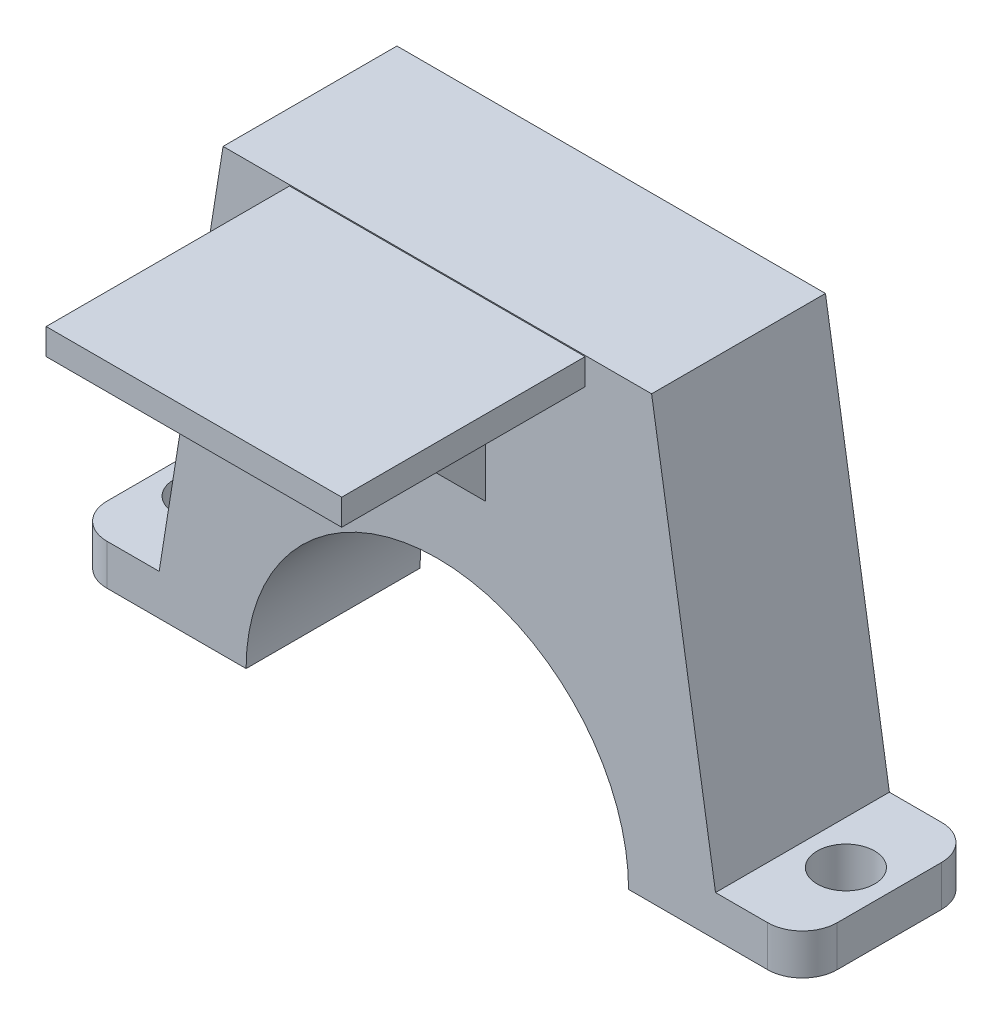
ISO-10303-21;
HEADER;
FILE_DESCRIPTION(('STEP AP214'),'2;1');
FILE_NAME('part.step','',(''),(''),'','','');
FILE_SCHEMA(('AUTOMOTIVE_DESIGN { 1 0 10303 214 1 1 1 1 }'));
ENDSEC;
DATA;
#1=APPLICATION_CONTEXT('core data for automotive mechanical design processes');
#2=APPLICATION_PROTOCOL_DEFINITION('international standard','automotive_design',2000,#1);
#3=PRODUCT_CONTEXT('',#1,'mechanical');
#4=PRODUCT('Part','Part','',(#3));
#5=PRODUCT_RELATED_PRODUCT_CATEGORY('part','',(#4));
#6=PRODUCT_DEFINITION_FORMATION('','',#4);
#7=PRODUCT_DEFINITION_CONTEXT('part definition',#1,'design');
#8=PRODUCT_DEFINITION('design','',#6,#7);
#9=PRODUCT_DEFINITION_SHAPE('','',#8);
#10=(LENGTH_UNIT() NAMED_UNIT(*) SI_UNIT(.MILLI.,.METRE.));
#11=(NAMED_UNIT(*) PLANE_ANGLE_UNIT() SI_UNIT($,.RADIAN.));
#12=(NAMED_UNIT(*) SI_UNIT($,.STERADIAN.) SOLID_ANGLE_UNIT());
#13=UNCERTAINTY_MEASURE_WITH_UNIT(LENGTH_MEASURE(1.E-05),#10,'distance_accuracy_value','');
#14=(GEOMETRIC_REPRESENTATION_CONTEXT(3) GLOBAL_UNCERTAINTY_ASSIGNED_CONTEXT((#13)) GLOBAL_UNIT_ASSIGNED_CONTEXT((#10,
#11,#12)) REPRESENTATION_CONTEXT('',''));
#15=CARTESIAN_POINT('',(0.,0.,0.));
#16=DIRECTION('',(0.,0.,1.));
#17=DIRECTION('',(1.,0.,0.));
#18=AXIS2_PLACEMENT_3D('',#15,#16,#17);
#19=CARTESIAN_POINT('',(0.,0.,10.));
#20=DIRECTION('',(0.,0.,-1.));
#21=DIRECTION('',(-1.,0.,0.));
#22=AXIS2_PLACEMENT_3D('',#19,#20,#21);
#23=PLANE('',#22);
#24=DIRECTION('',(-1.,0.,0.));
#25=VECTOR('',#24,1.);
#26=CARTESIAN_POINT('',(21.,0.,10.));
#27=LINE('',#26,#25);
#28=CARTESIAN_POINT('',(19.,0.,10.));
#29=VERTEX_POINT('',#28);
#30=CARTESIAN_POINT('',(11.,0.,10.));
#31=VERTEX_POINT('',#30);
#32=EDGE_CURVE('E247',#29,#31,#27,.T.);
#33=ORIENTED_EDGE('',*,*,#32,.F.);
#34=DIRECTION('',(0.,-1.,0.));
#35=VECTOR('',#34,1.);
#36=CARTESIAN_POINT('',(19.,2.34373044658664,10.));
#37=LINE('',#36,#35);
#38=CARTESIAN_POINT('',(19.,2.34373044658664,10.));
#39=VERTEX_POINT('',#38);
#40=EDGE_CURVE('E355',#29,#39,#37,.F.);
#41=ORIENTED_EDGE('',*,*,#40,.T.);
#42=DIRECTION('',(1.,0.,0.));
#43=VECTOR('',#42,1.);
#44=CARTESIAN_POINT('',(16.,2.34373044658664,10.));
#45=LINE('',#44,#43);
#46=CARTESIAN_POINT('',(16.,2.34373044658664,10.));
#47=VERTEX_POINT('',#46);
#48=EDGE_CURVE('E249',#47,#39,#45,.T.);
#49=ORIENTED_EDGE('',*,*,#48,.F.);
#50=DIRECTION('',(0.157759786540045,-0.987477518605279,0.));
#51=VECTOR('',#50,1.);
#52=CARTESIAN_POINT('',(12.3244688490504,25.3502548600488,10.));
#53=LINE('',#52,#51);
#54=CARTESIAN_POINT('',(12.3244688490504,25.3502548600488,10.));
#55=VERTEX_POINT('',#54);
#56=EDGE_CURVE('E253',#55,#47,#53,.T.);
#57=ORIENTED_EDGE('',*,*,#56,.F.);
#58=DIRECTION('',(-1.,0.,0.));
#59=VECTOR('',#58,1.);
#60=CARTESIAN_POINT('',(-12.3244688490504,25.3502548600488,10.));
#61=LINE('',#60,#59);
#62=CARTESIAN_POINT('',(-12.3244688490504,25.3502548600488,10.));
#63=VERTEX_POINT('',#62);
#64=EDGE_CURVE('E283',#55,#63,#61,.T.);
#65=ORIENTED_EDGE('',*,*,#64,.T.);
#66=DIRECTION('',(-0.157759786540045,-0.987477518605279,0.));
#67=VECTOR('',#66,1.);
#68=CARTESIAN_POINT('',(-12.3244688490504,25.3502548600488,10.));
#69=LINE('',#68,#67);
#70=CARTESIAN_POINT('',(-16.,2.34373044658664,10.));
#71=VERTEX_POINT('',#70);
#72=EDGE_CURVE('E286',#63,#71,#69,.T.);
#73=ORIENTED_EDGE('',*,*,#72,.T.);
#74=DIRECTION('',(-1.,0.,0.));
#75=VECTOR('',#74,1.);
#76=CARTESIAN_POINT('',(-16.,2.34373044658664,10.));
#77=LINE('',#76,#75);
#78=CARTESIAN_POINT('',(-19.,2.34373044658664,10.));
#79=VERTEX_POINT('',#78);
#80=EDGE_CURVE('E288',#71,#79,#77,.T.);
#81=ORIENTED_EDGE('',*,*,#80,.T.);
#82=DIRECTION('',(0.,-1.,0.));
#83=VECTOR('',#82,1.);
#84=CARTESIAN_POINT('',(-19.,0.,10.));
#85=LINE('',#84,#83);
#86=CARTESIAN_POINT('',(-19.,0.,10.));
#87=VERTEX_POINT('',#86);
#88=EDGE_CURVE('E336',#79,#87,#85,.T.);
#89=ORIENTED_EDGE('',*,*,#88,.T.);
#90=DIRECTION('',(1.,0.,0.));
#91=VECTOR('',#90,1.);
#92=CARTESIAN_POINT('',(-21.,0.,10.));
#93=LINE('',#92,#91);
#94=CARTESIAN_POINT('',(-11.,0.,10.));
#95=VERTEX_POINT('',#94);
#96=EDGE_CURVE('E291',#87,#95,#93,.T.);
#97=ORIENTED_EDGE('',*,*,#96,.T.);
#98=CARTESIAN_POINT('',(0.,0.,10.));
#99=DIRECTION('',(0.,0.,-1.));
#100=DIRECTION('',(-1.,0.,0.));
#101=AXIS2_PLACEMENT_3D('',#98,#99,#100);
#102=CIRCLE('',#101,11.);
#103=EDGE_CURVE('E280',#95,#31,#102,.T.);
#104=ORIENTED_EDGE('',*,*,#103,.T.);
#105=EDGE_LOOP('',(#33,#41,#49,#57,#65,#73,#81,#89,#97,#104));
#106=FACE_BOUND('',#105,.T.);
#107=DIRECTION('',(0.,1.,0.));
#108=VECTOR('',#107,1.);
#109=CARTESIAN_POINT('',(2.76086418443478,13.7897174261169,10.));
#110=LINE('',#109,#108);
#111=CARTESIAN_POINT('',(2.76086418443478,15.2184504977907,10.));
#112=VERTEX_POINT('',#111);
#113=CARTESIAN_POINT('',(2.76086418443478,23.7897174261169,10.));
#114=VERTEX_POINT('',#113);
#115=EDGE_CURVE('E190',#112,#114,#110,.T.);
#116=ORIENTED_EDGE('',*,*,#115,.F.);
#117=DIRECTION('',(-1.,0.,0.));
#118=VECTOR('',#117,1.);
#119=CARTESIAN_POINT('',(0.,15.2184504977907,10.));
#120=LINE('',#119,#118);
#121=CARTESIAN_POINT('',(-2.76086418443478,15.2184504977907,10.));
#122=VERTEX_POINT('',#121);
#123=EDGE_CURVE('E11',#112,#122,#120,.T.);
#124=ORIENTED_EDGE('',*,*,#123,.T.);
#125=DIRECTION('',(0.,1.,0.));
#126=VECTOR('',#125,1.);
#127=CARTESIAN_POINT('',(-2.76086418443478,13.7897174261169,10.));
#128=LINE('',#127,#126);
#129=CARTESIAN_POINT('',(-2.76086418443478,23.7897174261169,10.));
#130=VERTEX_POINT('',#129);
#131=EDGE_CURVE('E182',#122,#130,#128,.T.);
#132=ORIENTED_EDGE('',*,*,#131,.T.);
#133=DIRECTION('',(1.,0.,0.));
#134=VECTOR('',#133,1.);
#135=CARTESIAN_POINT('',(-8.5,23.7897174261169,10.));
#136=LINE('',#135,#134);
#137=CARTESIAN_POINT('',(-8.5,23.7897174261169,10.));
#138=VERTEX_POINT('',#137);
#139=EDGE_CURVE('E185',#138,#130,#136,.T.);
#140=ORIENTED_EDGE('',*,*,#139,.F.);
#141=DIRECTION('',(0.,-1.,0.));
#142=VECTOR('',#141,1.);
#143=CARTESIAN_POINT('',(-8.5,25.2897174261169,10.));
#144=LINE('',#143,#142);
#145=CARTESIAN_POINT('',(-8.5,25.2897174261169,10.));
#146=VERTEX_POINT('',#145);
#147=EDGE_CURVE('E189',#146,#138,#144,.T.);
#148=ORIENTED_EDGE('',*,*,#147,.F.);
#149=DIRECTION('',(1.,0.,0.));
#150=VECTOR('',#149,1.);
#151=CARTESIAN_POINT('',(-8.5,25.2897174261169,10.));
#152=LINE('',#151,#150);
#153=CARTESIAN_POINT('',(8.5,25.2897174261169,10.));
#154=VERTEX_POINT('',#153);
#155=EDGE_CURVE('E218',#146,#154,#152,.T.);
#156=ORIENTED_EDGE('',*,*,#155,.T.);
#157=DIRECTION('',(0.,-1.,0.));
#158=VECTOR('',#157,1.);
#159=CARTESIAN_POINT('',(8.5,25.2897174261169,10.));
#160=LINE('',#159,#158);
#161=CARTESIAN_POINT('',(8.5,23.7897174261169,10.));
#162=VERTEX_POINT('',#161);
#163=EDGE_CURVE('E202',#154,#162,#160,.T.);
#164=ORIENTED_EDGE('',*,*,#163,.T.);
#165=EDGE_CURVE('E203',#114,#162,#136,.T.);
#166=ORIENTED_EDGE('',*,*,#165,.F.);
#167=EDGE_LOOP('',(#116,#124,#132,#140,#148,#156,#164,#166));
#168=FACE_BOUND('',#167,.T.);
#169=ADVANCED_FACE('F43',(#106,#168),#23,.F.);
#170=CARTESIAN_POINT('',(-8.5,23.7897174261169,24.));
#171=DIRECTION('',(0.,1.,0.));
#172=DIRECTION('',(0.,0.,1.));
#173=AXIS2_PLACEMENT_3D('',#170,#171,#172);
#174=PLANE('',#173);
#175=DIRECTION('',(0.,0.,1.));
#176=VECTOR('',#175,1.);
#177=CARTESIAN_POINT('',(2.76086418443478,23.7897174261169,18.5712669283263));
#178=LINE('',#177,#176);
#179=CARTESIAN_POINT('',(2.76086418443478,23.7897174261169,18.5712669283263));
#180=VERTEX_POINT('',#179);
#181=EDGE_CURVE('E210',#114,#180,#178,.T.);
#182=ORIENTED_EDGE('',*,*,#181,.F.);
#183=ORIENTED_EDGE('',*,*,#165,.T.);
#184=DIRECTION('',(0.,0.,-1.));
#185=VECTOR('',#184,1.);
#186=CARTESIAN_POINT('',(8.5,23.7897174261169,24.));
#187=LINE('',#186,#185);
#188=CARTESIAN_POINT('',(8.5,23.7897174261169,24.));
#189=VERTEX_POINT('',#188);
#190=EDGE_CURVE('E236',#189,#162,#187,.T.);
#191=ORIENTED_EDGE('',*,*,#190,.F.);
#192=DIRECTION('',(1.,0.,0.));
#193=VECTOR('',#192,1.);
#194=CARTESIAN_POINT('',(-8.5,23.7897174261169,24.));
#195=LINE('',#194,#193);
#196=CARTESIAN_POINT('',(-8.5,23.7897174261169,24.));
#197=VERTEX_POINT('',#196);
#198=EDGE_CURVE('E217',#197,#189,#195,.T.);
#199=ORIENTED_EDGE('',*,*,#198,.F.);
#200=DIRECTION('',(0.,0.,-1.));
#201=VECTOR('',#200,1.);
#202=CARTESIAN_POINT('',(-8.5,23.7897174261169,24.));
#203=LINE('',#202,#201);
#204=EDGE_CURVE('E200',#197,#138,#203,.T.);
#205=ORIENTED_EDGE('',*,*,#204,.T.);
#206=ORIENTED_EDGE('',*,*,#139,.T.);
#207=DIRECTION('',(0.,0.,-1.));
#208=VECTOR('',#207,1.);
#209=CARTESIAN_POINT('',(-2.76086418443478,23.7897174261169,18.5712669283263));
#210=LINE('',#209,#208);
#211=CARTESIAN_POINT('',(-2.76086418443478,23.7897174261169,18.5712669283263));
#212=VERTEX_POINT('',#211);
#213=EDGE_CURVE('E197',#212,#130,#210,.T.);
#214=ORIENTED_EDGE('',*,*,#213,.F.);
#215=DIRECTION('',(-1.,0.,0.));
#216=VECTOR('',#215,1.);
#217=CARTESIAN_POINT('',(-2.76086418443478,23.7897174261169,18.5712669283263));
#218=LINE('',#217,#216);
#219=EDGE_CURVE('E207',#180,#212,#218,.T.);
#220=ORIENTED_EDGE('',*,*,#219,.F.);
#221=EDGE_LOOP('',(#182,#183,#191,#199,#205,#206,#214,#220));
#222=FACE_BOUND('',#221,.T.);
#223=ADVANCED_FACE('F195',(#222),#174,.F.);
#224=CARTESIAN_POINT('',(0.,0.,10.));
#225=DIRECTION('',(0.,0.,-1.));
#226=DIRECTION('',(-1.,0.,0.));
#227=AXIS2_PLACEMENT_3D('',#224,#225,#226);
#228=CYLINDRICAL_SURFACE('',#227,11.);
#229=CARTESIAN_POINT('',(0.,0.,0.));
#230=DIRECTION('',(0.,0.,-1.));
#231=DIRECTION('',(-1.,0.,0.));
#232=AXIS2_PLACEMENT_3D('',#229,#230,#231);
#233=CIRCLE('',#232,11.);
#234=CARTESIAN_POINT('',(-11.,0.,0.));
#235=VERTEX_POINT('',#234);
#236=CARTESIAN_POINT('',(11.,0.,0.));
#237=VERTEX_POINT('',#236);
#238=EDGE_CURVE('E294',#235,#237,#233,.T.);
#239=ORIENTED_EDGE('',*,*,#238,.T.);
#240=DIRECTION('',(0.,0.,-1.));
#241=VECTOR('',#240,1.);
#242=CARTESIAN_POINT('',(11.,0.,10.));
#243=LINE('',#242,#241);
#244=EDGE_CURVE('E273',#31,#237,#243,.T.);
#245=ORIENTED_EDGE('',*,*,#244,.F.);
#246=ORIENTED_EDGE('',*,*,#103,.F.);
#247=DIRECTION('',(0.,0.,-1.));
#248=VECTOR('',#247,1.);
#249=CARTESIAN_POINT('',(-11.,0.,10.));
#250=LINE('',#249,#248);
#251=EDGE_CURVE('E293',#95,#235,#250,.T.);
#252=ORIENTED_EDGE('',*,*,#251,.T.);
#253=EDGE_LOOP('',(#239,#245,#246,#252));
#254=FACE_BOUND('',#253,.T.);
#255=ADVANCED_FACE('F421',(#254),#228,.F.);
#256=CARTESIAN_POINT('',(-12.3244688490504,25.3502548600488,10.));
#257=DIRECTION('',(0.,-1.,0.));
#258=DIRECTION('',(1.,0.,0.));
#259=AXIS2_PLACEMENT_3D('',#256,#257,#258);
#260=PLANE('',#259);
#261=DIRECTION('',(-1.,0.,0.));
#262=VECTOR('',#261,1.);
#263=CARTESIAN_POINT('',(-12.3244688490504,25.3502548600488,0.));
#264=LINE('',#263,#262);
#265=CARTESIAN_POINT('',(12.3244688490504,25.3502548600488,0.));
#266=VERTEX_POINT('',#265);
#267=CARTESIAN_POINT('',(-12.3244688490504,25.3502548600488,0.));
#268=VERTEX_POINT('',#267);
#269=EDGE_CURVE('E297',#266,#268,#264,.T.);
#270=ORIENTED_EDGE('',*,*,#269,.T.);
#271=DIRECTION('',(0.,0.,-1.));
#272=VECTOR('',#271,1.);
#273=CARTESIAN_POINT('',(-12.3244688490504,25.3502548600488,10.));
#274=LINE('',#273,#272);
#275=EDGE_CURVE('E316',#63,#268,#274,.T.);
#276=ORIENTED_EDGE('',*,*,#275,.F.);
#277=ORIENTED_EDGE('',*,*,#64,.F.);
#278=DIRECTION('',(0.,0.,-1.));
#279=VECTOR('',#278,1.);
#280=CARTESIAN_POINT('',(12.3244688490504,25.3502548600488,10.));
#281=LINE('',#280,#279);
#282=EDGE_CURVE('E256',#55,#266,#281,.T.);
#283=ORIENTED_EDGE('',*,*,#282,.T.);
#284=EDGE_LOOP('',(#270,#276,#277,#283));
#285=FACE_BOUND('',#284,.T.);
#286=ADVANCED_FACE('F393',(#285),#260,.F.);
#287=CARTESIAN_POINT('',(-12.3244688490504,25.3502548600488,10.));
#288=DIRECTION('',(0.987477518605279,-0.157759786540045,0.));
#289=DIRECTION('',(0.157759786540045,0.987477518605279,0.));
#290=AXIS2_PLACEMENT_3D('',#287,#288,#289);
#291=PLANE('',#290);
#292=DIRECTION('',(-0.157759786540045,-0.987477518605279,0.));
#293=VECTOR('',#292,1.);
#294=CARTESIAN_POINT('',(-12.3244688490504,25.3502548600488,0.));
#295=LINE('',#294,#293);
#296=CARTESIAN_POINT('',(-16.,2.34373044658664,0.));
#297=VERTEX_POINT('',#296);
#298=EDGE_CURVE('E299',#268,#297,#295,.T.);
#299=ORIENTED_EDGE('',*,*,#298,.T.);
#300=DIRECTION('',(0.,0.,-1.));
#301=VECTOR('',#300,1.);
#302=CARTESIAN_POINT('',(-16.,2.34373044658664,10.));
#303=LINE('',#302,#301);
#304=EDGE_CURVE('E313',#71,#297,#303,.T.);
#305=ORIENTED_EDGE('',*,*,#304,.F.);
#306=ORIENTED_EDGE('',*,*,#72,.F.);
#307=ORIENTED_EDGE('',*,*,#275,.T.);
#308=EDGE_LOOP('',(#299,#305,#306,#307));
#309=FACE_BOUND('',#308,.T.);
#310=ADVANCED_FACE('F395',(#309),#291,.F.);
#311=CARTESIAN_POINT('',(-16.,2.34373044658664,10.));
#312=DIRECTION('',(0.,-1.,0.));
#313=DIRECTION('',(1.,0.,0.));
#314=AXIS2_PLACEMENT_3D('',#311,#312,#313);
#315=PLANE('',#314);
#316=CARTESIAN_POINT('',(-18.5,2.34373044658664,5.));
#317=DIRECTION('',(0.,1.,0.));
#318=DIRECTION('',(-1.,0.,0.));
#319=AXIS2_PLACEMENT_3D('',#316,#317,#318);
#320=CIRCLE('',#319,1.65);
#321=CARTESIAN_POINT('',(-20.15,2.34373044658664,5.));
#322=VERTEX_POINT('',#321);
#323=EDGE_CURVE('E276',#322,#322,#320,.T.);
#324=ORIENTED_EDGE('',*,*,#323,.F.);
#325=EDGE_LOOP('',(#324));
#326=FACE_BOUND('',#325,.T.);
#327=DIRECTION('',(-1.,0.,0.));
#328=VECTOR('',#327,1.);
#329=CARTESIAN_POINT('',(-16.,2.34373044658664,0.));
#330=LINE('',#329,#328);
#331=CARTESIAN_POINT('',(-19.,2.34373044658664,0.));
#332=VERTEX_POINT('',#331);
#333=EDGE_CURVE('E301',#297,#332,#330,.T.);
#334=ORIENTED_EDGE('',*,*,#333,.T.);
#335=CARTESIAN_POINT('',(-19.,2.34373044658664,2.));
#336=DIRECTION('',(0.,-1.,0.));
#337=DIRECTION('',(1.,0.,0.));
#338=AXIS2_PLACEMENT_3D('',#335,#336,#337);
#339=CIRCLE('',#338,2.);
#340=CARTESIAN_POINT('',(-21.,2.34373044658664,2.));
#341=VERTEX_POINT('',#340);
#342=EDGE_CURVE('E334',#332,#341,#339,.F.);
#343=ORIENTED_EDGE('',*,*,#342,.T.);
#344=DIRECTION('',(0.,0.,-1.));
#345=VECTOR('',#344,1.);
#346=CARTESIAN_POINT('',(-21.,2.34373044658664,10.));
#347=LINE('',#346,#345);
#348=CARTESIAN_POINT('',(-21.,2.34373044658664,8.));
#349=VERTEX_POINT('',#348);
#350=EDGE_CURVE('E310',#349,#341,#347,.T.);
#351=ORIENTED_EDGE('',*,*,#350,.F.);
#352=CARTESIAN_POINT('',(-19.,2.34373044658664,8.));
#353=DIRECTION('',(0.,-1.,0.));
#354=DIRECTION('',(1.,0.,0.));
#355=AXIS2_PLACEMENT_3D('',#352,#353,#354);
#356=CIRCLE('',#355,2.);
#357=EDGE_CURVE('E332',#349,#79,#356,.F.);
#358=ORIENTED_EDGE('',*,*,#357,.T.);
#359=ORIENTED_EDGE('',*,*,#80,.F.);
#360=ORIENTED_EDGE('',*,*,#304,.T.);
#361=EDGE_LOOP('',(#334,#343,#351,#358,#359,#360));
#362=FACE_BOUND('',#361,.T.);
#363=ADVANCED_FACE('F399',(#326,#362),#315,.F.);
#364=CARTESIAN_POINT('',(-21.,0.,10.));
#365=DIRECTION('',(1.,0.,0.));
#366=DIRECTION('',(0.,0.,-1.));
#367=AXIS2_PLACEMENT_3D('',#364,#365,#366);
#368=PLANE('',#367);
#369=ORIENTED_EDGE('',*,*,#350,.T.);
#370=DIRECTION('',(0.,-1.,0.));
#371=VECTOR('',#370,1.);
#372=CARTESIAN_POINT('',(-21.,0.,2.));
#373=LINE('',#372,#371);
#374=CARTESIAN_POINT('',(-21.,0.,2.));
#375=VERTEX_POINT('',#374);
#376=EDGE_CURVE('E323',#341,#375,#373,.T.);
#377=ORIENTED_EDGE('',*,*,#376,.T.);
#378=DIRECTION('',(0.,0.,-1.));
#379=VECTOR('',#378,1.);
#380=CARTESIAN_POINT('',(-21.,0.,10.));
#381=LINE('',#380,#379);
#382=CARTESIAN_POINT('',(-21.,0.,8.));
#383=VERTEX_POINT('',#382);
#384=EDGE_CURVE('E307',#383,#375,#381,.T.);
#385=ORIENTED_EDGE('',*,*,#384,.F.);
#386=DIRECTION('',(0.,-1.,0.));
#387=VECTOR('',#386,1.);
#388=CARTESIAN_POINT('',(-21.,0.,8.));
#389=LINE('',#388,#387);
#390=EDGE_CURVE('E319',#383,#349,#389,.F.);
#391=ORIENTED_EDGE('',*,*,#390,.T.);
#392=EDGE_LOOP('',(#369,#377,#385,#391));
#393=FACE_BOUND('',#392,.T.);
#394=ADVANCED_FACE('F412',(#393),#368,.F.);
#395=CARTESIAN_POINT('',(-21.,0.,10.));
#396=DIRECTION('',(0.,1.,0.));
#397=DIRECTION('',(-1.,0.,0.));
#398=AXIS2_PLACEMENT_3D('',#395,#396,#397);
#399=PLANE('',#398);
#400=CARTESIAN_POINT('',(-18.5,0.,5.));
#401=DIRECTION('',(0.,1.,0.));
#402=DIRECTION('',(-1.,0.,0.));
#403=AXIS2_PLACEMENT_3D('',#400,#401,#402);
#404=CIRCLE('',#403,1.65);
#405=CARTESIAN_POINT('',(-20.15,0.,5.));
#406=VERTEX_POINT('',#405);
#407=EDGE_CURVE('E279',#406,#406,#404,.T.);
#408=ORIENTED_EDGE('',*,*,#407,.T.);
#409=EDGE_LOOP('',(#408));
#410=FACE_BOUND('',#409,.T.);
#411=ORIENTED_EDGE('',*,*,#384,.T.);
#412=CARTESIAN_POINT('',(-19.,0.,2.));
#413=DIRECTION('',(0.,1.,0.));
#414=DIRECTION('',(-1.,0.,0.));
#415=AXIS2_PLACEMENT_3D('',#412,#413,#414);
#416=CIRCLE('',#415,2.);
#417=CARTESIAN_POINT('',(-19.,0.,0.));
#418=VERTEX_POINT('',#417);
#419=EDGE_CURVE('E328',#375,#418,#416,.F.);
#420=ORIENTED_EDGE('',*,*,#419,.T.);
#421=DIRECTION('',(1.,0.,0.));
#422=VECTOR('',#421,1.);
#423=CARTESIAN_POINT('',(-21.,0.,0.));
#424=LINE('',#423,#422);
#425=EDGE_CURVE('E284',#418,#235,#424,.T.);
#426=ORIENTED_EDGE('',*,*,#425,.T.);
#427=ORIENTED_EDGE('',*,*,#251,.F.);
#428=ORIENTED_EDGE('',*,*,#96,.F.);
#429=CARTESIAN_POINT('',(-19.,0.,8.));
#430=DIRECTION('',(0.,1.,0.));
#431=DIRECTION('',(-1.,0.,0.));
#432=AXIS2_PLACEMENT_3D('',#429,#430,#431);
#433=CIRCLE('',#432,2.);
#434=EDGE_CURVE('E326',#87,#383,#433,.F.);
#435=ORIENTED_EDGE('',*,*,#434,.T.);
#436=EDGE_LOOP('',(#411,#420,#426,#427,#428,#435));
#437=FACE_BOUND('',#436,.T.);
#438=ADVANCED_FACE('F409',(#410,#437),#399,.F.);
#439=CARTESIAN_POINT('',(0.,0.,0.));
#440=DIRECTION('',(0.,0.,-1.));
#441=DIRECTION('',(-1.,0.,0.));
#442=AXIS2_PLACEMENT_3D('',#439,#440,#441);
#443=PLANE('',#442);
#444=DIRECTION('',(1.,0.,0.));
#445=VECTOR('',#444,1.);
#446=CARTESIAN_POINT('',(16.,2.34373044658664,0.));
#447=LINE('',#446,#445);
#448=CARTESIAN_POINT('',(16.,2.34373044658664,0.));
#449=VERTEX_POINT('',#448);
#450=CARTESIAN_POINT('',(19.,2.34373044658664,0.));
#451=VERTEX_POINT('',#450);
#452=EDGE_CURVE('E258',#449,#451,#447,.T.);
#453=ORIENTED_EDGE('',*,*,#452,.T.);
#454=DIRECTION('',(0.,-1.,0.));
#455=VECTOR('',#454,1.);
#456=CARTESIAN_POINT('',(19.,0.,0.));
#457=LINE('',#456,#455);
#458=CARTESIAN_POINT('',(19.,0.,0.));
#459=VERTEX_POINT('',#458);
#460=EDGE_CURVE('E339',#451,#459,#457,.T.);
#461=ORIENTED_EDGE('',*,*,#460,.T.);
#462=DIRECTION('',(-1.,0.,0.));
#463=VECTOR('',#462,1.);
#464=CARTESIAN_POINT('',(21.,0.,0.));
#465=LINE('',#464,#463);
#466=EDGE_CURVE('E246',#459,#237,#465,.T.);
#467=ORIENTED_EDGE('',*,*,#466,.T.);
#468=ORIENTED_EDGE('',*,*,#238,.F.);
#469=ORIENTED_EDGE('',*,*,#425,.F.);
#470=DIRECTION('',(0.,-1.,0.));
#471=VECTOR('',#470,1.);
#472=CARTESIAN_POINT('',(-19.,2.34373044658664,0.));
#473=LINE('',#472,#471);
#474=EDGE_CURVE('E330',#418,#332,#473,.F.);
#475=ORIENTED_EDGE('',*,*,#474,.T.);
#476=ORIENTED_EDGE('',*,*,#333,.F.);
#477=ORIENTED_EDGE('',*,*,#298,.F.);
#478=ORIENTED_EDGE('',*,*,#269,.F.);
#479=DIRECTION('',(0.157759786540045,-0.987477518605279,0.));
#480=VECTOR('',#479,1.);
#481=CARTESIAN_POINT('',(12.3244688490504,25.3502548600488,0.));
#482=LINE('',#481,#480);
#483=EDGE_CURVE('E250',#266,#449,#482,.T.);
#484=ORIENTED_EDGE('',*,*,#483,.T.);
#485=EDGE_LOOP('',(#453,#461,#467,#468,#469,#475,#476,#477,#478,#484));
#486=FACE_BOUND('',#485,.T.);
#487=ADVANCED_FACE('F382',(#486),#443,.T.);
#488=CARTESIAN_POINT('',(-18.5,-7.65626955341336,5.));
#489=DIRECTION('',(0.,1.,0.));
#490=DIRECTION('',(-1.,0.,0.));
#491=AXIS2_PLACEMENT_3D('',#488,#489,#490);
#492=CYLINDRICAL_SURFACE('',#491,1.65);
#493=ORIENTED_EDGE('',*,*,#323,.T.);
#494=EDGE_LOOP('',(#493));
#495=FACE_BOUND('',#494,.T.);
#496=ORIENTED_EDGE('',*,*,#407,.F.);
#497=EDGE_LOOP('',(#496));
#498=FACE_BOUND('',#497,.T.);
#499=ADVANCED_FACE('F438',(#495,#498),#492,.F.);
#500=CARTESIAN_POINT('',(-19.,0.,2.));
#501=DIRECTION('',(0.,1.,0.));
#502=DIRECTION('',(0.,0.,1.));
#503=AXIS2_PLACEMENT_3D('',#500,#501,#502);
#504=CYLINDRICAL_SURFACE('',#503,2.);
#505=ORIENTED_EDGE('',*,*,#342,.F.);
#506=ORIENTED_EDGE('',*,*,#474,.F.);
#507=ORIENTED_EDGE('',*,*,#419,.F.);
#508=ORIENTED_EDGE('',*,*,#376,.F.);
#509=EDGE_LOOP('',(#505,#506,#507,#508));
#510=FACE_BOUND('',#509,.T.);
#511=ADVANCED_FACE('F416',(#510),#504,.T.);
#512=CARTESIAN_POINT('',(-19.,0.,8.));
#513=DIRECTION('',(0.,-1.,0.));
#514=DIRECTION('',(0.,0.,-1.));
#515=AXIS2_PLACEMENT_3D('',#512,#513,#514);
#516=CYLINDRICAL_SURFACE('',#515,2.);
#517=ORIENTED_EDGE('',*,*,#357,.F.);
#518=ORIENTED_EDGE('',*,*,#390,.F.);
#519=ORIENTED_EDGE('',*,*,#434,.F.);
#520=ORIENTED_EDGE('',*,*,#88,.F.);
#521=EDGE_LOOP('',(#517,#518,#519,#520));
#522=FACE_BOUND('',#521,.T.);
#523=ADVANCED_FACE('F405',(#522),#516,.T.);
#524=CARTESIAN_POINT('',(21.,0.,10.));
#525=DIRECTION('',(0.,-1.,0.));
#526=DIRECTION('',(1.,0.,0.));
#527=AXIS2_PLACEMENT_3D('',#524,#525,#526);
#528=PLANE('',#527);
#529=CARTESIAN_POINT('',(18.5,0.,5.));
#530=DIRECTION('',(0.,-1.,0.));
#531=DIRECTION('',(1.,0.,0.));
#532=AXIS2_PLACEMENT_3D('',#529,#530,#531);
#533=CIRCLE('',#532,1.65);
#534=CARTESIAN_POINT('',(20.15,0.,5.));
#535=VERTEX_POINT('',#534);
#536=EDGE_CURVE('E243',#535,#535,#533,.F.);
#537=ORIENTED_EDGE('',*,*,#536,.T.);
#538=EDGE_LOOP('',(#537));
#539=FACE_BOUND('',#538,.T.);
#540=ORIENTED_EDGE('',*,*,#466,.F.);
#541=CARTESIAN_POINT('',(19.,0.,2.));
#542=DIRECTION('',(0.,-1.,0.));
#543=DIRECTION('',(1.,0.,0.));
#544=AXIS2_PLACEMENT_3D('',#541,#542,#543);
#545=CIRCLE('',#544,2.);
#546=CARTESIAN_POINT('',(21.,0.,2.));
#547=VERTEX_POINT('',#546);
#548=EDGE_CURVE('E344',#459,#547,#545,.T.);
#549=ORIENTED_EDGE('',*,*,#548,.T.);
#550=DIRECTION('',(0.,0.,-1.));
#551=VECTOR('',#550,1.);
#552=CARTESIAN_POINT('',(21.,0.,10.));
#553=LINE('',#552,#551);
#554=CARTESIAN_POINT('',(21.,0.,8.));
#555=VERTEX_POINT('',#554);
#556=EDGE_CURVE('E270',#555,#547,#553,.T.);
#557=ORIENTED_EDGE('',*,*,#556,.F.);
#558=CARTESIAN_POINT('',(19.,0.,8.));
#559=DIRECTION('',(0.,-1.,0.));
#560=DIRECTION('',(1.,0.,0.));
#561=AXIS2_PLACEMENT_3D('',#558,#559,#560);
#562=CIRCLE('',#561,2.);
#563=EDGE_CURVE('E342',#555,#29,#562,.T.);
#564=ORIENTED_EDGE('',*,*,#563,.T.);
#565=ORIENTED_EDGE('',*,*,#32,.T.);
#566=ORIENTED_EDGE('',*,*,#244,.T.);
#567=EDGE_LOOP('',(#540,#549,#557,#564,#565,#566));
#568=FACE_BOUND('',#567,.T.);
#569=ADVANCED_FACE('F376',(#539,#568),#528,.T.);
#570=CARTESIAN_POINT('',(21.,0.,10.));
#571=DIRECTION('',(1.,0.,0.));
#572=DIRECTION('',(0.,0.,-1.));
#573=AXIS2_PLACEMENT_3D('',#570,#571,#572);
#574=PLANE('',#573);
#575=ORIENTED_EDGE('',*,*,#556,.T.);
#576=DIRECTION('',(0.,-1.,0.));
#577=VECTOR('',#576,1.);
#578=CARTESIAN_POINT('',(21.,0.,2.));
#579=LINE('',#578,#577);
#580=CARTESIAN_POINT('',(21.,2.34373044658664,2.));
#581=VERTEX_POINT('',#580);
#582=EDGE_CURVE('E349',#547,#581,#579,.F.);
#583=ORIENTED_EDGE('',*,*,#582,.T.);
#584=DIRECTION('',(0.,0.,-1.));
#585=VECTOR('',#584,1.);
#586=CARTESIAN_POINT('',(21.,2.34373044658664,10.));
#587=LINE('',#586,#585);
#588=CARTESIAN_POINT('',(21.,2.34373044658664,8.));
#589=VERTEX_POINT('',#588);
#590=EDGE_CURVE('E267',#589,#581,#587,.T.);
#591=ORIENTED_EDGE('',*,*,#590,.F.);
#592=DIRECTION('',(0.,-1.,0.));
#593=VECTOR('',#592,1.);
#594=CARTESIAN_POINT('',(21.,0.,8.));
#595=LINE('',#594,#593);
#596=EDGE_CURVE('E346',#589,#555,#595,.T.);
#597=ORIENTED_EDGE('',*,*,#596,.T.);
#598=EDGE_LOOP('',(#575,#583,#591,#597));
#599=FACE_BOUND('',#598,.T.);
#600=ADVANCED_FACE('F372',(#599),#574,.T.);
#601=CARTESIAN_POINT('',(16.,2.34373044658664,10.));
#602=DIRECTION('',(0.,1.,0.));
#603=DIRECTION('',(-1.,0.,0.));
#604=AXIS2_PLACEMENT_3D('',#601,#602,#603);
#605=PLANE('',#604);
#606=CARTESIAN_POINT('',(18.5,2.34373044658664,5.));
#607=DIRECTION('',(0.,-1.,0.));
#608=DIRECTION('',(1.,0.,0.));
#609=AXIS2_PLACEMENT_3D('',#606,#607,#608);
#610=CIRCLE('',#609,1.65);
#611=CARTESIAN_POINT('',(20.15,2.34373044658664,5.));
#612=VERTEX_POINT('',#611);
#613=EDGE_CURVE('E240',#612,#612,#610,.T.);
#614=ORIENTED_EDGE('',*,*,#613,.T.);
#615=EDGE_LOOP('',(#614));
#616=FACE_BOUND('',#615,.T.);
#617=ORIENTED_EDGE('',*,*,#590,.T.);
#618=CARTESIAN_POINT('',(19.,2.34373044658664,2.));
#619=DIRECTION('',(0.,1.,0.));
#620=DIRECTION('',(-1.,0.,0.));
#621=AXIS2_PLACEMENT_3D('',#618,#619,#620);
#622=CIRCLE('',#621,2.);
#623=EDGE_CURVE('E353',#581,#451,#622,.T.);
#624=ORIENTED_EDGE('',*,*,#623,.T.);
#625=ORIENTED_EDGE('',*,*,#452,.F.);
#626=DIRECTION('',(0.,0.,-1.));
#627=VECTOR('',#626,1.);
#628=CARTESIAN_POINT('',(16.,2.34373044658664,10.));
#629=LINE('',#628,#627);
#630=EDGE_CURVE('E265',#47,#449,#629,.T.);
#631=ORIENTED_EDGE('',*,*,#630,.F.);
#632=ORIENTED_EDGE('',*,*,#48,.T.);
#633=CARTESIAN_POINT('',(19.,2.34373044658664,8.));
#634=DIRECTION('',(0.,1.,0.));
#635=DIRECTION('',(-1.,0.,0.));
#636=AXIS2_PLACEMENT_3D('',#633,#634,#635);
#637=CIRCLE('',#636,2.);
#638=EDGE_CURVE('E351',#39,#589,#637,.T.);
#639=ORIENTED_EDGE('',*,*,#638,.T.);
#640=EDGE_LOOP('',(#617,#624,#625,#631,#632,#639));
#641=FACE_BOUND('',#640,.T.);
#642=ADVANCED_FACE('F365',(#616,#641),#605,.T.);
#643=CARTESIAN_POINT('',(12.3244688490504,25.3502548600488,10.));
#644=DIRECTION('',(0.987477518605279,0.157759786540045,0.));
#645=DIRECTION('',(-0.157759786540045,0.987477518605279,0.));
#646=AXIS2_PLACEMENT_3D('',#643,#644,#645);
#647=PLANE('',#646);
#648=ORIENTED_EDGE('',*,*,#483,.F.);
#649=ORIENTED_EDGE('',*,*,#282,.F.);
#650=ORIENTED_EDGE('',*,*,#56,.T.);
#651=ORIENTED_EDGE('',*,*,#630,.T.);
#652=EDGE_LOOP('',(#648,#649,#650,#651));
#653=FACE_BOUND('',#652,.T.);
#654=ADVANCED_FACE('F388',(#653),#647,.T.);
#655=CARTESIAN_POINT('',(18.5,-7.65626955341336,5.));
#656=DIRECTION('',(0.,1.,0.));
#657=DIRECTION('',(-1.,0.,0.));
#658=AXIS2_PLACEMENT_3D('',#655,#656,#657);
#659=CYLINDRICAL_SURFACE('',#658,1.65);
#660=ORIENTED_EDGE('',*,*,#536,.F.);
#661=EDGE_LOOP('',(#660));
#662=FACE_BOUND('',#661,.T.);
#663=ORIENTED_EDGE('',*,*,#613,.F.);
#664=EDGE_LOOP('',(#663));
#665=FACE_BOUND('',#664,.T.);
#666=ADVANCED_FACE('F513',(#662,#665),#659,.F.);
#667=CARTESIAN_POINT('',(19.,0.,2.));
#668=DIRECTION('',(0.,-1.,0.));
#669=DIRECTION('',(0.,0.,-1.));
#670=AXIS2_PLACEMENT_3D('',#667,#668,#669);
#671=CYLINDRICAL_SURFACE('',#670,2.);
#672=ORIENTED_EDGE('',*,*,#623,.F.);
#673=ORIENTED_EDGE('',*,*,#582,.F.);
#674=ORIENTED_EDGE('',*,*,#548,.F.);
#675=ORIENTED_EDGE('',*,*,#460,.F.);
#676=EDGE_LOOP('',(#672,#673,#674,#675));
#677=FACE_BOUND('',#676,.T.);
#678=ADVANCED_FACE('F380',(#677),#671,.T.);
#679=CARTESIAN_POINT('',(19.,0.,8.));
#680=DIRECTION('',(0.,1.,0.));
#681=DIRECTION('',(0.,0.,1.));
#682=AXIS2_PLACEMENT_3D('',#679,#680,#681);
#683=CYLINDRICAL_SURFACE('',#682,2.);
#684=ORIENTED_EDGE('',*,*,#638,.F.);
#685=ORIENTED_EDGE('',*,*,#40,.F.);
#686=ORIENTED_EDGE('',*,*,#563,.F.);
#687=ORIENTED_EDGE('',*,*,#596,.F.);
#688=EDGE_LOOP('',(#684,#685,#686,#687));
#689=FACE_BOUND('',#688,.T.);
#690=ADVANCED_FACE('F369',(#689),#683,.T.);
#691=CARTESIAN_POINT('',(-8.5,25.2897174261169,24.));
#692=DIRECTION('',(1.,0.,0.));
#693=DIRECTION('',(0.,0.,-1.));
#694=AXIS2_PLACEMENT_3D('',#691,#692,#693);
#695=PLANE('',#694);
#696=ORIENTED_EDGE('',*,*,#147,.T.);
#697=ORIENTED_EDGE('',*,*,#204,.F.);
#698=DIRECTION('',(0.,-1.,0.));
#699=VECTOR('',#698,1.);
#700=CARTESIAN_POINT('',(-8.5,25.2897174261169,24.));
#701=LINE('',#700,#699);
#702=CARTESIAN_POINT('',(-8.5,25.2897174261169,24.));
#703=VERTEX_POINT('',#702);
#704=EDGE_CURVE('E214',#703,#197,#701,.T.);
#705=ORIENTED_EDGE('',*,*,#704,.F.);
#706=DIRECTION('',(0.,0.,-1.));
#707=VECTOR('',#706,1.);
#708=CARTESIAN_POINT('',(-8.5,25.2897174261169,24.));
#709=LINE('',#708,#707);
#710=EDGE_CURVE('E226',#703,#146,#709,.T.);
#711=ORIENTED_EDGE('',*,*,#710,.T.);
#712=EDGE_LOOP('',(#696,#697,#705,#711));
#713=FACE_BOUND('',#712,.T.);
#714=ADVANCED_FACE('F533',(#713),#695,.F.);
#715=CARTESIAN_POINT('',(8.5,25.2897174261169,24.));
#716=DIRECTION('',(1.,0.,0.));
#717=DIRECTION('',(0.,0.,-1.));
#718=AXIS2_PLACEMENT_3D('',#715,#716,#717);
#719=PLANE('',#718);
#720=ORIENTED_EDGE('',*,*,#163,.F.);
#721=DIRECTION('',(0.,0.,-1.));
#722=VECTOR('',#721,1.);
#723=CARTESIAN_POINT('',(8.5,25.2897174261169,24.));
#724=LINE('',#723,#722);
#725=CARTESIAN_POINT('',(8.5,25.2897174261169,24.));
#726=VERTEX_POINT('',#725);
#727=EDGE_CURVE('E233',#726,#154,#724,.T.);
#728=ORIENTED_EDGE('',*,*,#727,.F.);
#729=DIRECTION('',(0.,-1.,0.));
#730=VECTOR('',#729,1.);
#731=CARTESIAN_POINT('',(8.5,25.2897174261169,24.));
#732=LINE('',#731,#730);
#733=EDGE_CURVE('E220',#726,#189,#732,.T.);
#734=ORIENTED_EDGE('',*,*,#733,.T.);
#735=ORIENTED_EDGE('',*,*,#190,.T.);
#736=EDGE_LOOP('',(#720,#728,#734,#735));
#737=FACE_BOUND('',#736,.T.);
#738=ADVANCED_FACE('F539',(#737),#719,.T.);
#739=CARTESIAN_POINT('',(-8.5,25.2897174261169,24.));
#740=DIRECTION('',(0.,1.,0.));
#741=DIRECTION('',(0.,0.,1.));
#742=AXIS2_PLACEMENT_3D('',#739,#740,#741);
#743=PLANE('',#742);
#744=ORIENTED_EDGE('',*,*,#155,.F.);
#745=ORIENTED_EDGE('',*,*,#710,.F.);
#746=DIRECTION('',(1.,0.,0.));
#747=VECTOR('',#746,1.);
#748=CARTESIAN_POINT('',(-8.5,25.2897174261169,24.));
#749=LINE('',#748,#747);
#750=EDGE_CURVE('E223',#703,#726,#749,.T.);
#751=ORIENTED_EDGE('',*,*,#750,.T.);
#752=ORIENTED_EDGE('',*,*,#727,.T.);
#753=EDGE_LOOP('',(#744,#745,#751,#752));
#754=FACE_BOUND('',#753,.T.);
#755=ADVANCED_FACE('F547',(#754),#743,.T.);
#756=CARTESIAN_POINT('',(0.,0.,24.));
#757=DIRECTION('',(0.,0.,1.));
#758=DIRECTION('',(1.,0.,0.));
#759=AXIS2_PLACEMENT_3D('',#756,#757,#758);
#760=PLANE('',#759);
#761=ORIENTED_EDGE('',*,*,#704,.T.);
#762=ORIENTED_EDGE('',*,*,#198,.T.);
#763=ORIENTED_EDGE('',*,*,#733,.F.);
#764=ORIENTED_EDGE('',*,*,#750,.F.);
#765=EDGE_LOOP('',(#761,#762,#763,#764));
#766=FACE_BOUND('',#765,.T.);
#767=ADVANCED_FACE('F555',(#766),#760,.T.);
#768=CARTESIAN_POINT('',(2.76086418443478,13.7897174261169,18.5712669283263));
#769=DIRECTION('',(-1.,0.,0.));
#770=DIRECTION('',(0.,0.,1.));
#771=AXIS2_PLACEMENT_3D('',#768,#769,#770);
#772=PLANE('',#771);
#773=ORIENTED_EDGE('',*,*,#181,.T.);
#774=DIRECTION('',(0.,-0.707106781186544,-0.707106781186551));
#775=VECTOR('',#774,1.);
#776=CARTESIAN_POINT('',(2.76086418443478,13.7897174261169,8.57126692832614));
#777=LINE('',#776,#775);
#778=EDGE_CURVE('E52',#180,#112,#777,.T.);
#779=ORIENTED_EDGE('',*,*,#778,.T.);
#780=ORIENTED_EDGE('',*,*,#115,.T.);
#781=EDGE_LOOP('',(#773,#779,#780));
#782=FACE_BOUND('',#781,.T.);
#783=ADVANCED_FACE('F563',(#782),#772,.F.);
#784=CARTESIAN_POINT('',(-2.76086418443478,13.7897174261169,18.5712669283263));
#785=DIRECTION('',(1.,0.,0.));
#786=DIRECTION('',(0.,0.,-1.));
#787=AXIS2_PLACEMENT_3D('',#784,#785,#786);
#788=PLANE('',#787);
#789=ORIENTED_EDGE('',*,*,#131,.F.);
#790=DIRECTION('',(0.,0.707106781186544,0.707106781186551));
#791=VECTOR('',#790,1.);
#792=CARTESIAN_POINT('',(-2.76086418443478,13.7897174261169,8.57126692832614));
#793=LINE('',#792,#791);
#794=EDGE_CURVE('E206',#122,#212,#793,.T.);
#795=ORIENTED_EDGE('',*,*,#794,.T.);
#796=ORIENTED_EDGE('',*,*,#213,.T.);
#797=EDGE_LOOP('',(#789,#795,#796));
#798=FACE_BOUND('',#797,.T.);
#799=ADVANCED_FACE('F205',(#798),#788,.F.);
#800=CARTESIAN_POINT('',(0.,13.7897174261169,8.57126692832614));
#801=DIRECTION('',(0.,-0.707106781186551,0.707106781186544));
#802=DIRECTION('',(1.,0.,0.));
#803=AXIS2_PLACEMENT_3D('',#800,#801,#802);
#804=PLANE('',#803);
#805=ORIENTED_EDGE('',*,*,#778,.F.);
#806=ORIENTED_EDGE('',*,*,#219,.T.);
#807=ORIENTED_EDGE('',*,*,#794,.F.);
#808=ORIENTED_EDGE('',*,*,#123,.F.);
#809=EDGE_LOOP('',(#805,#806,#807,#808));
#810=FACE_BOUND('',#809,.T.);
#811=ADVANCED_FACE('F46',(#810),#804,.T.);
#812=CLOSED_SHELL('',(#169,#223,#255,#286,#310,#363,#394,#438,#487,#499,#511,#523,#569,#600,
#642,#654,#666,#678,#690,#714,#738,#755,#767,#783,#799,#811));
#813=MANIFOLD_SOLID_BREP('B2',#812);
#814=ADVANCED_BREP_SHAPE_REPRESENTATION('',(#18,#813),#14);
#815=SHAPE_DEFINITION_REPRESENTATION(#9,#814);
ENDSEC;
END-ISO-10303-21;
